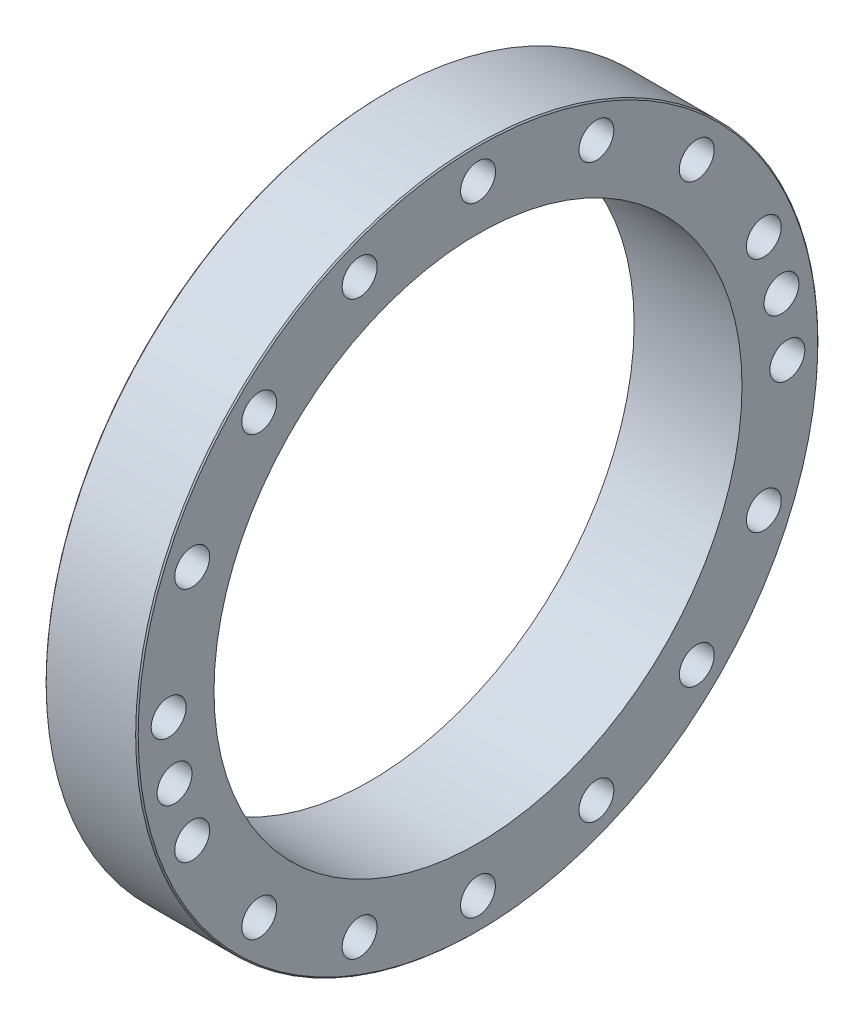
ISO-10303-21;
HEADER;
FILE_DESCRIPTION(('STEP AP214'),'2;1');
FILE_NAME('part.step','',(''),(''),'','','');
FILE_SCHEMA(('AUTOMOTIVE_DESIGN { 1 0 10303 214 1 1 1 1 }'));
ENDSEC;
DATA;
#1=APPLICATION_CONTEXT('core data for automotive mechanical design processes');
#2=APPLICATION_PROTOCOL_DEFINITION('international standard','automotive_design',2000,#1);
#3=PRODUCT_CONTEXT('',#1,'mechanical');
#4=PRODUCT('Part','Part','',(#3));
#5=PRODUCT_RELATED_PRODUCT_CATEGORY('part','',(#4));
#6=PRODUCT_DEFINITION_FORMATION('','',#4);
#7=PRODUCT_DEFINITION_CONTEXT('part definition',#1,'design');
#8=PRODUCT_DEFINITION('design','',#6,#7);
#9=PRODUCT_DEFINITION_SHAPE('','',#8);
#10=(LENGTH_UNIT() NAMED_UNIT(*) SI_UNIT(.MILLI.,.METRE.));
#11=(NAMED_UNIT(*) PLANE_ANGLE_UNIT() SI_UNIT($,.RADIAN.));
#12=(NAMED_UNIT(*) SI_UNIT($,.STERADIAN.) SOLID_ANGLE_UNIT());
#13=UNCERTAINTY_MEASURE_WITH_UNIT(LENGTH_MEASURE(1.E-05),#10,'distance_accuracy_value','');
#14=(GEOMETRIC_REPRESENTATION_CONTEXT(3) GLOBAL_UNCERTAINTY_ASSIGNED_CONTEXT((#13)) GLOBAL_UNIT_ASSIGNED_CONTEXT((#10,
#11,#12)) REPRESENTATION_CONTEXT('',''));
#15=CARTESIAN_POINT('',(0.,0.,0.));
#16=DIRECTION('',(0.,0.,1.));
#17=DIRECTION('',(1.,0.,0.));
#18=AXIS2_PLACEMENT_3D('',#15,#16,#17);
#19=CARTESIAN_POINT('',(60.1,-19.0213063965725,95.626564839315));
#20=DIRECTION('',(-1.,0.,0.));
#21=DIRECTION('',(0.,0.,1.));
#22=AXIS2_PLACEMENT_3D('',#19,#20,#21);
#23=CYLINDRICAL_SURFACE('',#22,4.25);
#24=CARTESIAN_POINT('',(66.8499999999312,-19.0213063965725,95.626564839315));
#25=DIRECTION('',(1.,0.,0.));
#26=DIRECTION('',(0.,0.195090322018536,-0.980785280402751));
#27=AXIS2_PLACEMENT_3D('',#24,#25,#26);
#28=CIRCLE('',#27,4.24999999995026);
#29=CARTESIAN_POINT('',(66.8499999999312,-18.1921725280034,91.4582273976521));
#30=VERTEX_POINT('',#29);
#31=EDGE_CURVE('E30',#30,#30,#28,.T.);
#32=ORIENTED_EDGE('',*,*,#31,.T.);
#33=EDGE_LOOP('',(#32));
#34=FACE_BOUND('',#33,.T.);
#35=CARTESIAN_POINT('',(53.3500000000231,-19.0213063965725,95.626564839315));
#36=DIRECTION('',(-1.,0.,0.));
#37=DIRECTION('',(0.,0.195090322016634,-0.98078528040313));
#38=AXIS2_PLACEMENT_3D('',#35,#36,#37);
#39=CIRCLE('',#38,4.25000000006453);
#40=CARTESIAN_POINT('',(53.3500000000231,-18.1921725279892,91.4582273975384));
#41=VERTEX_POINT('',#40);
#42=EDGE_CURVE('E173',#41,#41,#39,.T.);
#43=ORIENTED_EDGE('',*,*,#42,.T.);
#44=EDGE_LOOP('',(#43));
#45=FACE_BOUND('',#44,.T.);
#46=ADVANCED_FACE('F15',(#34,#45),#23,.F.);
#47=CARTESIAN_POINT('',(60.1,19.0213063965725,-95.626564839315));
#48=DIRECTION('',(-1.,0.,0.));
#49=DIRECTION('',(0.,0.,1.));
#50=AXIS2_PLACEMENT_3D('',#47,#48,#49);
#51=CYLINDRICAL_SURFACE('',#50,4.25);
#52=CARTESIAN_POINT('',(66.8499999999312,19.0213063965725,-95.626564839315));
#53=DIRECTION('',(1.,0.,0.));
#54=DIRECTION('',(0.,-0.195090322018536,0.980785280402751));
#55=AXIS2_PLACEMENT_3D('',#52,#53,#54);
#56=CIRCLE('',#55,4.24999999995026);
#57=CARTESIAN_POINT('',(66.8499999999312,18.1921725280034,-91.4582273976521));
#58=VERTEX_POINT('',#57);
#59=EDGE_CURVE('E179',#58,#58,#56,.T.);
#60=ORIENTED_EDGE('',*,*,#59,.T.);
#61=EDGE_LOOP('',(#60));
#62=FACE_BOUND('',#61,.T.);
#63=CARTESIAN_POINT('',(53.3500000000231,19.0213063965725,-95.626564839315));
#64=DIRECTION('',(-1.,0.,0.));
#65=DIRECTION('',(0.,-0.195090322016634,0.98078528040313));
#66=AXIS2_PLACEMENT_3D('',#63,#64,#65);
#67=CIRCLE('',#66,4.25000000006453);
#68=CARTESIAN_POINT('',(53.3500000000231,18.1921725279892,-91.4582273975384));
#69=VERTEX_POINT('',#68);
#70=EDGE_CURVE('E168',#69,#69,#67,.T.);
#71=ORIENTED_EDGE('',*,*,#70,.T.);
#72=EDGE_LOOP('',(#71));
#73=FACE_BOUND('',#72,.T.);
#74=ADVANCED_FACE('F191',(#62,#73),#51,.F.);
#75=CARTESIAN_POINT('',(67.5999999999704,-19.0213063965725,95.626564839315));
#76=DIRECTION('',(1.,0.,0.));
#77=DIRECTION('',(0.,0.,-1.));
#78=AXIS2_PLACEMENT_3D('',#75,#76,#77);
#79=CONICAL_SURFACE('',#78,4.99999999995781,0.785398163377527);
#80=CARTESIAN_POINT('',(67.5999999999704,-19.0213063965725,95.626564839315));
#81=DIRECTION('',(1.,0.,0.));
#82=DIRECTION('',(0.,0.,-1.));
#83=AXIS2_PLACEMENT_3D('',#80,#81,#82);
#84=CIRCLE('',#83,4.99999999995781);
#85=CARTESIAN_POINT('',(67.5999999999704,-19.0213063965725,90.6265648393572));
#86=VERTEX_POINT('',#85);
#87=EDGE_CURVE('E18',#86,#86,#84,.T.);
#88=ORIENTED_EDGE('',*,*,#87,.T.);
#89=EDGE_LOOP('',(#88));
#90=FACE_BOUND('',#89,.T.);
#91=ORIENTED_EDGE('',*,*,#31,.F.);
#92=EDGE_LOOP('',(#91));
#93=FACE_BOUND('',#92,.T.);
#94=ADVANCED_FACE('F188',(#90,#93),#79,.F.);
#95=CARTESIAN_POINT('',(67.5999999999704,19.0213063965725,-95.626564839315));
#96=DIRECTION('',(1.,0.,0.));
#97=DIRECTION('',(0.,0.,-1.));
#98=AXIS2_PLACEMENT_3D('',#95,#96,#97);
#99=CONICAL_SURFACE('',#98,4.99999999995781,0.785398163377527);
#100=CARTESIAN_POINT('',(67.5999999999704,19.0213063965725,-95.626564839315));
#101=DIRECTION('',(1.,0.,0.));
#102=DIRECTION('',(0.,0.,-1.));
#103=AXIS2_PLACEMENT_3D('',#100,#101,#102);
#104=CIRCLE('',#103,4.99999999995781);
#105=CARTESIAN_POINT('',(67.5999999999704,19.0213063965725,-100.626564839273));
#106=VERTEX_POINT('',#105);
#107=EDGE_CURVE('E159',#106,#106,#104,.T.);
#108=ORIENTED_EDGE('',*,*,#107,.T.);
#109=EDGE_LOOP('',(#108));
#110=FACE_BOUND('',#109,.T.);
#111=ORIENTED_EDGE('',*,*,#59,.F.);
#112=EDGE_LOOP('',(#111));
#113=FACE_BOUND('',#112,.T.);
#114=ADVANCED_FACE('F190',(#110,#113),#99,.F.);
#115=CARTESIAN_POINT('',(52.5999999999271,-19.0213063965725,95.626564839315));
#116=DIRECTION('',(-1.,0.,0.));
#117=DIRECTION('',(0.,0.,1.));
#118=AXIS2_PLACEMENT_3D('',#115,#116,#117);
#119=CONICAL_SURFACE('',#118,5.00000000013338,0.785398163417663);
#120=ORIENTED_EDGE('',*,*,#42,.F.);
#121=EDGE_LOOP('',(#120));
#122=FACE_BOUND('',#121,.T.);
#123=CARTESIAN_POINT('',(52.5999999999666,-19.0213063965725,95.626564839315));
#124=DIRECTION('',(-1.,0.,0.));
#125=DIRECTION('',(0.,0.,1.));
#126=AXIS2_PLACEMENT_3D('',#123,#124,#125);
#127=CIRCLE('',#126,5.00000000009395);
#128=CARTESIAN_POINT('',(52.5999999999666,-19.0213063965725,100.626564839409));
#129=VERTEX_POINT('',#128);
#130=EDGE_CURVE('E157',#129,#129,#127,.F.);
#131=ORIENTED_EDGE('',*,*,#130,.F.);
#132=EDGE_LOOP('',(#131));
#133=FACE_BOUND('',#132,.T.);
#134=ADVANCED_FACE('F198',(#122,#133),#119,.F.);
#135=CARTESIAN_POINT('',(52.5999999999271,19.0213063965725,-95.626564839315));
#136=DIRECTION('',(-1.,0.,0.));
#137=DIRECTION('',(0.,0.,1.));
#138=AXIS2_PLACEMENT_3D('',#135,#136,#137);
#139=CONICAL_SURFACE('',#138,5.00000000013338,0.785398163417663);
#140=ORIENTED_EDGE('',*,*,#70,.F.);
#141=EDGE_LOOP('',(#140));
#142=FACE_BOUND('',#141,.T.);
#143=CARTESIAN_POINT('',(52.5999999999666,19.0213063965725,-95.626564839315));
#144=DIRECTION('',(-1.,0.,0.));
#145=DIRECTION('',(0.,0.,1.));
#146=AXIS2_PLACEMENT_3D('',#143,#144,#145);
#147=CIRCLE('',#146,5.00000000009395);
#148=CARTESIAN_POINT('',(52.5999999999666,19.0213063965725,-90.626564839221));
#149=VERTEX_POINT('',#148);
#150=EDGE_CURVE('E154',#149,#149,#147,.F.);
#151=ORIENTED_EDGE('',*,*,#150,.F.);
#152=EDGE_LOOP('',(#151));
#153=FACE_BOUND('',#152,.T.);
#154=ADVANCED_FACE('F317',(#142,#153),#139,.F.);
#155=CARTESIAN_POINT('',(50.5,0.,0.));
#156=DIRECTION('',(-1.,0.,0.));
#157=DIRECTION('',(0.,0.,1.));
#158=AXIS2_PLACEMENT_3D('',#155,#156,#157);
#159=CYLINDRICAL_SURFACE('',#158,88.5);
#160=CARTESIAN_POINT('',(52.6,0.,0.));
#161=DIRECTION('',(-1.,0.,0.));
#162=DIRECTION('',(0.,0.,1.));
#163=AXIS2_PLACEMENT_3D('',#160,#161,#162);
#164=CIRCLE('',#163,88.5);
#165=CARTESIAN_POINT('',(52.6,0.,88.5));
#166=VERTEX_POINT('',#165);
#167=EDGE_CURVE('E148',#166,#166,#164,.F.);
#168=ORIENTED_EDGE('',*,*,#167,.F.);
#169=EDGE_LOOP('',(#168));
#170=FACE_BOUND('',#169,.T.);
#171=CARTESIAN_POINT('',(48.4,0.,0.));
#172=DIRECTION('',(1.,0.,0.));
#173=DIRECTION('',(0.,0.,1.));
#174=AXIS2_PLACEMENT_3D('',#171,#172,#173);
#175=CIRCLE('',#174,88.5);
#176=CARTESIAN_POINT('',(48.4,0.,88.5));
#177=VERTEX_POINT('',#176);
#178=EDGE_CURVE('E164',#177,#177,#175,.F.);
#179=ORIENTED_EDGE('',*,*,#178,.F.);
#180=EDGE_LOOP('',(#179));
#181=FACE_BOUND('',#180,.T.);
#182=ADVANCED_FACE('F314',(#170,#181),#159,.T.);
#183=CARTESIAN_POINT('',(48.4,0.,0.));
#184=DIRECTION('',(1.,0.,0.));
#185=DIRECTION('',(0.,0.,-1.));
#186=AXIS2_PLACEMENT_3D('',#183,#184,#185);
#187=CONICAL_SURFACE('',#186,88.5,0.785398163397448);
#188=ORIENTED_EDGE('',*,*,#178,.T.);
#189=EDGE_LOOP('',(#188));
#190=FACE_BOUND('',#189,.T.);
#191=CARTESIAN_POINT('',(47.6,0.,0.));
#192=DIRECTION('',(1.,0.,0.));
#193=DIRECTION('',(0.,0.,-1.));
#194=AXIS2_PLACEMENT_3D('',#191,#192,#193);
#195=CIRCLE('',#194,87.7);
#196=CARTESIAN_POINT('',(47.6,0.,-87.7));
#197=VERTEX_POINT('',#196);
#198=EDGE_CURVE('E145',#197,#197,#195,.F.);
#199=ORIENTED_EDGE('',*,*,#198,.F.);
#200=EDGE_LOOP('',(#199));
#201=FACE_BOUND('',#200,.T.);
#202=ADVANCED_FACE('F310',(#190,#201),#187,.T.);
#203=CARTESIAN_POINT('',(53.,0.,0.));
#204=DIRECTION('',(1.,0.,0.));
#205=DIRECTION('',(0.,0.,-1.));
#206=AXIS2_PLACEMENT_3D('',#203,#204,#205);
#207=CONICAL_SURFACE('',#206,107.5,0.785398163397448);
#208=CARTESIAN_POINT('',(53.,0.,0.));
#209=DIRECTION('',(-1.,0.,0.));
#210=DIRECTION('',(0.,0.,1.));
#211=AXIS2_PLACEMENT_3D('',#208,#209,#210);
#212=CIRCLE('',#211,107.5);
#213=CARTESIAN_POINT('',(53.,0.,107.5));
#214=VERTEX_POINT('',#213);
#215=EDGE_CURVE('E144',#214,#214,#212,.F.);
#216=ORIENTED_EDGE('',*,*,#215,.F.);
#217=EDGE_LOOP('',(#216));
#218=FACE_BOUND('',#217,.T.);
#219=CARTESIAN_POINT('',(52.6,0.,0.));
#220=DIRECTION('',(1.,0.,0.));
#221=DIRECTION('',(0.,0.,-1.));
#222=AXIS2_PLACEMENT_3D('',#219,#220,#221);
#223=CIRCLE('',#222,107.1);
#224=CARTESIAN_POINT('',(52.6,0.,-107.1));
#225=VERTEX_POINT('',#224);
#226=EDGE_CURVE('E151',#225,#225,#223,.F.);
#227=ORIENTED_EDGE('',*,*,#226,.F.);
#228=EDGE_LOOP('',(#227));
#229=FACE_BOUND('',#228,.T.);
#230=ADVANCED_FACE('F306',(#218,#229),#207,.T.);
#231=CARTESIAN_POINT('',(67.6,-19.5578047821169,98.3237243604239));
#232=DIRECTION('',(-1.,0.,0.));
#233=DIRECTION('',(0.,0.,1.));
#234=AXIS2_PLACEMENT_3D('',#231,#232,#233);
#235=PLANE('',#234);
#236=CARTESIAN_POINT('',(67.6,-19.0213063965725,95.626564839315));
#237=DIRECTION('',(-1.,0.,0.));
#238=DIRECTION('',(0.,0.,1.));
#239=AXIS2_PLACEMENT_3D('',#236,#237,#238);
#240=CIRCLE('',#239,5.5);
#241=CARTESIAN_POINT('',(67.6,-19.0213063965725,101.126564839315));
#242=VERTEX_POINT('',#241);
#243=EDGE_CURVE('E141',#242,#242,#240,.F.);
#244=ORIENTED_EDGE('',*,*,#243,.T.);
#245=EDGE_LOOP('',(#244));
#246=FACE_BOUND('',#245,.T.);
#247=ORIENTED_EDGE('',*,*,#87,.F.);
#248=EDGE_LOOP('',(#247));
#249=FACE_BOUND('',#248,.T.);
#250=ADVANCED_FACE('F302',(#246,#249),#235,.F.);
#251=CARTESIAN_POINT('',(67.6,19.5578047821169,-98.3237243604239));
#252=DIRECTION('',(-1.,0.,0.));
#253=DIRECTION('',(0.,0.,1.));
#254=AXIS2_PLACEMENT_3D('',#251,#252,#253);
#255=PLANE('',#254);
#256=CARTESIAN_POINT('',(67.6,19.0213063965725,-95.626564839315));
#257=DIRECTION('',(-1.,0.,0.));
#258=DIRECTION('',(0.,0.,1.));
#259=AXIS2_PLACEMENT_3D('',#256,#257,#258);
#260=CIRCLE('',#259,5.5);
#261=CARTESIAN_POINT('',(67.6,19.0213063965725,-90.126564839315));
#262=VERTEX_POINT('',#261);
#263=EDGE_CURVE('E138',#262,#262,#260,.F.);
#264=ORIENTED_EDGE('',*,*,#263,.T.);
#265=EDGE_LOOP('',(#264));
#266=FACE_BOUND('',#265,.T.);
#267=ORIENTED_EDGE('',*,*,#107,.F.);
#268=EDGE_LOOP('',(#267));
#269=FACE_BOUND('',#268,.T.);
#270=ADVANCED_FACE('F298',(#266,#269),#255,.F.);
#271=CARTESIAN_POINT('',(52.6,0.,97.8));
#272=DIRECTION('',(-1.,0.,0.));
#273=DIRECTION('',(0.,0.,1.));
#274=AXIS2_PLACEMENT_3D('',#271,#272,#273);
#275=PLANE('',#274);
#276=ORIENTED_EDGE('',*,*,#167,.T.);
#277=EDGE_LOOP('',(#276));
#278=FACE_BOUND('',#277,.T.);
#279=ORIENTED_EDGE('',*,*,#226,.T.);
#280=EDGE_LOOP('',(#279));
#281=FACE_BOUND('',#280,.T.);
#282=CARTESIAN_POINT('',(52.6,0.,-97.5));
#283=DIRECTION('',(-1.,0.,0.));
#284=DIRECTION('',(0.,0.,1.));
#285=AXIS2_PLACEMENT_3D('',#282,#283,#284);
#286=CIRCLE('',#285,5.5);
#287=CARTESIAN_POINT('',(52.6,0.,-92.));
#288=VERTEX_POINT('',#287);
#289=EDGE_CURVE('E90',#288,#288,#286,.F.);
#290=ORIENTED_EDGE('',*,*,#289,.T.);
#291=EDGE_LOOP('',(#290));
#292=FACE_BOUND('',#291,.T.);
#293=CARTESIAN_POINT('',(52.6,37.3116346555963,-90.0782544198505));
#294=DIRECTION('',(-1.,0.,0.));
#295=DIRECTION('',(0.,0.,1.));
#296=AXIS2_PLACEMENT_3D('',#293,#294,#295);
#297=CIRCLE('',#296,5.5);
#298=CARTESIAN_POINT('',(52.6,37.3116346555963,-84.5782544198505));
#299=VERTEX_POINT('',#298);
#300=EDGE_CURVE('E93',#299,#299,#297,.F.);
#301=ORIENTED_EDGE('',*,*,#300,.T.);
#302=EDGE_LOOP('',(#301));
#303=FACE_BOUND('',#302,.T.);
#304=CARTESIAN_POINT('',(52.6,68.9429111656884,-68.9429111656884));
#305=DIRECTION('',(-1.,0.,0.));
#306=DIRECTION('',(0.,0.,1.));
#307=AXIS2_PLACEMENT_3D('',#304,#305,#306);
#308=CIRCLE('',#307,5.5);
#309=CARTESIAN_POINT('',(52.6,68.9429111656884,-63.4429111656884));
#310=VERTEX_POINT('',#309);
#311=EDGE_CURVE('E96',#310,#310,#308,.F.);
#312=ORIENTED_EDGE('',*,*,#311,.T.);
#313=EDGE_LOOP('',(#312));
#314=FACE_BOUND('',#313,.T.);
#315=CARTESIAN_POINT('',(52.6,90.0782544198505,-37.3116346555963));
#316=DIRECTION('',(-1.,0.,0.));
#317=DIRECTION('',(0.,0.,1.));
#318=AXIS2_PLACEMENT_3D('',#315,#316,#317);
#319=CIRCLE('',#318,5.5);
#320=CARTESIAN_POINT('',(52.6,90.0782544198505,-31.8116346555963));
#321=VERTEX_POINT('',#320);
#322=EDGE_CURVE('E99',#321,#321,#319,.F.);
#323=ORIENTED_EDGE('',*,*,#322,.T.);
#324=EDGE_LOOP('',(#323));
#325=FACE_BOUND('',#324,.T.);
#326=CARTESIAN_POINT('',(52.6,97.5,0.));
#327=DIRECTION('',(-1.,0.,0.));
#328=DIRECTION('',(0.,0.,1.));
#329=AXIS2_PLACEMENT_3D('',#326,#327,#328);
#330=CIRCLE('',#329,5.5);
#331=CARTESIAN_POINT('',(52.6,97.5,5.5));
#332=VERTEX_POINT('',#331);
#333=EDGE_CURVE('E102',#332,#332,#330,.F.);
#334=ORIENTED_EDGE('',*,*,#333,.T.);
#335=EDGE_LOOP('',(#334));
#336=FACE_BOUND('',#335,.T.);
#337=CARTESIAN_POINT('',(52.6,90.0782544198505,37.3116346555963));
#338=DIRECTION('',(-1.,0.,0.));
#339=DIRECTION('',(0.,0.,1.));
#340=AXIS2_PLACEMENT_3D('',#337,#338,#339);
#341=CIRCLE('',#340,5.5);
#342=CARTESIAN_POINT('',(52.6,90.0782544198505,42.8116346555963));
#343=VERTEX_POINT('',#342);
#344=EDGE_CURVE('E105',#343,#343,#341,.F.);
#345=ORIENTED_EDGE('',*,*,#344,.T.);
#346=EDGE_LOOP('',(#345));
#347=FACE_BOUND('',#346,.T.);
#348=CARTESIAN_POINT('',(52.6,68.9429111656884,68.9429111656884));
#349=DIRECTION('',(-1.,0.,0.));
#350=DIRECTION('',(0.,0.,1.));
#351=AXIS2_PLACEMENT_3D('',#348,#349,#350);
#352=CIRCLE('',#351,5.5);
#353=CARTESIAN_POINT('',(52.6,68.9429111656884,74.4429111656884));
#354=VERTEX_POINT('',#353);
#355=EDGE_CURVE('E108',#354,#354,#352,.F.);
#356=ORIENTED_EDGE('',*,*,#355,.T.);
#357=EDGE_LOOP('',(#356));
#358=FACE_BOUND('',#357,.T.);
#359=CARTESIAN_POINT('',(52.6,37.3116346555962,90.0782544198505));
#360=DIRECTION('',(-1.,0.,0.));
#361=DIRECTION('',(0.,0.,1.));
#362=AXIS2_PLACEMENT_3D('',#359,#360,#361);
#363=CIRCLE('',#362,5.5);
#364=CARTESIAN_POINT('',(52.6,37.3116346555962,95.5782544198505));
#365=VERTEX_POINT('',#364);
#366=EDGE_CURVE('E111',#365,#365,#363,.F.);
#367=ORIENTED_EDGE('',*,*,#366,.T.);
#368=EDGE_LOOP('',(#367));
#369=FACE_BOUND('',#368,.T.);
#370=CARTESIAN_POINT('',(52.6,0.,97.5));
#371=DIRECTION('',(-1.,0.,0.));
#372=DIRECTION('',(0.,0.,1.));
#373=AXIS2_PLACEMENT_3D('',#370,#371,#372);
#374=CIRCLE('',#373,5.5);
#375=CARTESIAN_POINT('',(52.6,0.,103.));
#376=VERTEX_POINT('',#375);
#377=EDGE_CURVE('E114',#376,#376,#374,.F.);
#378=ORIENTED_EDGE('',*,*,#377,.T.);
#379=EDGE_LOOP('',(#378));
#380=FACE_BOUND('',#379,.T.);
#381=CARTESIAN_POINT('',(52.6,-37.3116346555962,90.0782544198505));
#382=DIRECTION('',(-1.,0.,0.));
#383=DIRECTION('',(0.,0.,1.));
#384=AXIS2_PLACEMENT_3D('',#381,#382,#383);
#385=CIRCLE('',#384,5.5);
#386=CARTESIAN_POINT('',(52.6,-37.3116346555962,95.5782544198505));
#387=VERTEX_POINT('',#386);
#388=EDGE_CURVE('E117',#387,#387,#385,.F.);
#389=ORIENTED_EDGE('',*,*,#388,.T.);
#390=EDGE_LOOP('',(#389));
#391=FACE_BOUND('',#390,.T.);
#392=CARTESIAN_POINT('',(52.6,-68.9429111656884,68.9429111656884));
#393=DIRECTION('',(-1.,0.,0.));
#394=DIRECTION('',(0.,0.,1.));
#395=AXIS2_PLACEMENT_3D('',#392,#393,#394);
#396=CIRCLE('',#395,5.5);
#397=CARTESIAN_POINT('',(52.6,-68.9429111656884,74.4429111656884));
#398=VERTEX_POINT('',#397);
#399=EDGE_CURVE('E120',#398,#398,#396,.F.);
#400=ORIENTED_EDGE('',*,*,#399,.T.);
#401=EDGE_LOOP('',(#400));
#402=FACE_BOUND('',#401,.T.);
#403=CARTESIAN_POINT('',(52.6,-90.0782544198505,37.3116346555962));
#404=DIRECTION('',(-1.,0.,0.));
#405=DIRECTION('',(0.,0.,1.));
#406=AXIS2_PLACEMENT_3D('',#403,#404,#405);
#407=CIRCLE('',#406,5.5);
#408=CARTESIAN_POINT('',(52.6,-90.0782544198505,42.8116346555962));
#409=VERTEX_POINT('',#408);
#410=EDGE_CURVE('E123',#409,#409,#407,.F.);
#411=ORIENTED_EDGE('',*,*,#410,.T.);
#412=EDGE_LOOP('',(#411));
#413=FACE_BOUND('',#412,.T.);
#414=CARTESIAN_POINT('',(52.6,-97.5,0.));
#415=DIRECTION('',(-1.,0.,0.));
#416=DIRECTION('',(0.,0.,1.));
#417=AXIS2_PLACEMENT_3D('',#414,#415,#416);
#418=CIRCLE('',#417,5.5);
#419=CARTESIAN_POINT('',(52.6,-97.5,5.5));
#420=VERTEX_POINT('',#419);
#421=EDGE_CURVE('E126',#420,#420,#418,.F.);
#422=ORIENTED_EDGE('',*,*,#421,.T.);
#423=EDGE_LOOP('',(#422));
#424=FACE_BOUND('',#423,.T.);
#425=CARTESIAN_POINT('',(52.6,-90.0782544198505,-37.3116346555963));
#426=DIRECTION('',(-1.,0.,0.));
#427=DIRECTION('',(0.,0.,1.));
#428=AXIS2_PLACEMENT_3D('',#425,#426,#427);
#429=CIRCLE('',#428,5.5);
#430=CARTESIAN_POINT('',(52.6,-90.0782544198505,-31.8116346555963));
#431=VERTEX_POINT('',#430);
#432=EDGE_CURVE('E129',#431,#431,#429,.F.);
#433=ORIENTED_EDGE('',*,*,#432,.T.);
#434=EDGE_LOOP('',(#433));
#435=FACE_BOUND('',#434,.T.);
#436=CARTESIAN_POINT('',(52.6,-68.9429111656883,-68.9429111656884));
#437=DIRECTION('',(-1.,0.,0.));
#438=DIRECTION('',(0.,0.,1.));
#439=AXIS2_PLACEMENT_3D('',#436,#437,#438);
#440=CIRCLE('',#439,5.5);
#441=CARTESIAN_POINT('',(52.6,-68.9429111656883,-63.4429111656884));
#442=VERTEX_POINT('',#441);
#443=EDGE_CURVE('E132',#442,#442,#440,.F.);
#444=ORIENTED_EDGE('',*,*,#443,.T.);
#445=EDGE_LOOP('',(#444));
#446=FACE_BOUND('',#445,.T.);
#447=CARTESIAN_POINT('',(52.6,-37.3116346555962,-90.0782544198505));
#448=DIRECTION('',(-1.,0.,0.));
#449=DIRECTION('',(0.,0.,1.));
#450=AXIS2_PLACEMENT_3D('',#447,#448,#449);
#451=CIRCLE('',#450,5.5);
#452=CARTESIAN_POINT('',(52.6,-37.3116346555962,-84.5782544198505));
#453=VERTEX_POINT('',#452);
#454=EDGE_CURVE('E135',#453,#453,#451,.F.);
#455=ORIENTED_EDGE('',*,*,#454,.T.);
#456=EDGE_LOOP('',(#455));
#457=FACE_BOUND('',#456,.T.);
#458=ORIENTED_EDGE('',*,*,#150,.T.);
#459=EDGE_LOOP('',(#458));
#460=FACE_BOUND('',#459,.T.);
#461=ORIENTED_EDGE('',*,*,#130,.T.);
#462=EDGE_LOOP('',(#461));
#463=FACE_BOUND('',#462,.T.);
#464=ADVANCED_FACE('F294',(#278,#281,#292,#303,#314,#325,#336,#347,#358,#369,#380,#391,#402,
#413,#424,#435,#446,#457,#460,#463),#275,.T.);
#465=CARTESIAN_POINT('',(47.6,0.,85.452));
#466=DIRECTION('',(-1.,0.,0.));
#467=DIRECTION('',(0.,0.,1.));
#468=AXIS2_PLACEMENT_3D('',#465,#466,#467);
#469=PLANE('',#468);
#470=CARTESIAN_POINT('',(47.6,0.,0.));
#471=DIRECTION('',(-1.,0.,0.));
#472=DIRECTION('',(0.,0.,1.));
#473=AXIS2_PLACEMENT_3D('',#470,#471,#472);
#474=CIRCLE('',#473,83.204);
#475=CARTESIAN_POINT('',(47.6,0.,83.204));
#476=VERTEX_POINT('',#475);
#477=EDGE_CURVE('E87',#476,#476,#474,.F.);
#478=ORIENTED_EDGE('',*,*,#477,.T.);
#479=EDGE_LOOP('',(#478));
#480=FACE_BOUND('',#479,.T.);
#481=ORIENTED_EDGE('',*,*,#198,.T.);
#482=EDGE_LOOP('',(#481));
#483=FACE_BOUND('',#482,.T.);
#484=ADVANCED_FACE('F290',(#480,#483),#469,.T.);
#485=CARTESIAN_POINT('',(67.1,0.,0.));
#486=DIRECTION('',(-1.,0.,0.));
#487=DIRECTION('',(0.,0.,1.));
#488=AXIS2_PLACEMENT_3D('',#485,#486,#487);
#489=CYLINDRICAL_SURFACE('',#488,107.5);
#490=CARTESIAN_POINT('',(81.2,0.,0.));
#491=DIRECTION('',(-1.,0.,0.));
#492=DIRECTION('',(0.,0.,1.));
#493=AXIS2_PLACEMENT_3D('',#490,#491,#492);
#494=CIRCLE('',#493,107.5);
#495=CARTESIAN_POINT('',(81.2,0.,107.5));
#496=VERTEX_POINT('',#495);
#497=EDGE_CURVE('E86',#496,#496,#494,.F.);
#498=ORIENTED_EDGE('',*,*,#497,.F.);
#499=EDGE_LOOP('',(#498));
#500=FACE_BOUND('',#499,.T.);
#501=ORIENTED_EDGE('',*,*,#215,.T.);
#502=EDGE_LOOP('',(#501));
#503=FACE_BOUND('',#502,.T.);
#504=ADVANCED_FACE('F286',(#500,#503),#489,.T.);
#505=CARTESIAN_POINT('',(74.6,-19.0213063965725,95.626564839315));
#506=DIRECTION('',(-1.,0.,0.));
#507=DIRECTION('',(0.,0.,1.));
#508=AXIS2_PLACEMENT_3D('',#505,#506,#507);
#509=CYLINDRICAL_SURFACE('',#508,5.5);
#510=CARTESIAN_POINT('',(81.6,-19.0213063965725,95.626564839315));
#511=DIRECTION('',(-1.,0.,0.));
#512=DIRECTION('',(0.,0.,1.));
#513=AXIS2_PLACEMENT_3D('',#510,#511,#512);
#514=CIRCLE('',#513,5.5);
#515=CARTESIAN_POINT('',(81.6,-19.0213063965725,101.126564839315));
#516=VERTEX_POINT('',#515);
#517=EDGE_CURVE('E83',#516,#516,#514,.T.);
#518=ORIENTED_EDGE('',*,*,#517,.F.);
#519=EDGE_LOOP('',(#518));
#520=FACE_BOUND('',#519,.T.);
#521=ORIENTED_EDGE('',*,*,#243,.F.);
#522=EDGE_LOOP('',(#521));
#523=FACE_BOUND('',#522,.T.);
#524=ADVANCED_FACE('F282',(#520,#523),#509,.F.);
#525=CARTESIAN_POINT('',(74.6,19.0213063965725,-95.626564839315));
#526=DIRECTION('',(-1.,0.,0.));
#527=DIRECTION('',(0.,0.,1.));
#528=AXIS2_PLACEMENT_3D('',#525,#526,#527);
#529=CYLINDRICAL_SURFACE('',#528,5.5);
#530=CARTESIAN_POINT('',(81.6,19.0213063965725,-95.626564839315));
#531=DIRECTION('',(-1.,0.,0.));
#532=DIRECTION('',(0.,0.,1.));
#533=AXIS2_PLACEMENT_3D('',#530,#531,#532);
#534=CIRCLE('',#533,5.5);
#535=CARTESIAN_POINT('',(81.6,19.0213063965725,-90.126564839315));
#536=VERTEX_POINT('',#535);
#537=EDGE_CURVE('E80',#536,#536,#534,.T.);
#538=ORIENTED_EDGE('',*,*,#537,.F.);
#539=EDGE_LOOP('',(#538));
#540=FACE_BOUND('',#539,.T.);
#541=ORIENTED_EDGE('',*,*,#263,.F.);
#542=EDGE_LOOP('',(#541));
#543=FACE_BOUND('',#542,.T.);
#544=ADVANCED_FACE('F278',(#540,#543),#529,.F.);
#545=CARTESIAN_POINT('',(67.1,-37.3116346555962,-90.0782544198505));
#546=DIRECTION('',(-1.,0.,0.));
#547=DIRECTION('',(0.,0.,1.));
#548=AXIS2_PLACEMENT_3D('',#545,#546,#547);
#549=CYLINDRICAL_SURFACE('',#548,5.5);
#550=CARTESIAN_POINT('',(81.6,-37.3116346555962,-90.0782544198505));
#551=DIRECTION('',(-1.,0.,0.));
#552=DIRECTION('',(0.,0.,1.));
#553=AXIS2_PLACEMENT_3D('',#550,#551,#552);
#554=CIRCLE('',#553,5.5);
#555=CARTESIAN_POINT('',(81.6,-37.3116346555962,-84.5782544198505));
#556=VERTEX_POINT('',#555);
#557=EDGE_CURVE('E77',#556,#556,#554,.T.);
#558=ORIENTED_EDGE('',*,*,#557,.F.);
#559=EDGE_LOOP('',(#558));
#560=FACE_BOUND('',#559,.T.);
#561=ORIENTED_EDGE('',*,*,#454,.F.);
#562=EDGE_LOOP('',(#561));
#563=FACE_BOUND('',#562,.T.);
#564=ADVANCED_FACE('F274',(#560,#563),#549,.F.);
#565=CARTESIAN_POINT('',(67.1,-68.9429111656883,-68.9429111656884));
#566=DIRECTION('',(-1.,0.,0.));
#567=DIRECTION('',(0.,0.,1.));
#568=AXIS2_PLACEMENT_3D('',#565,#566,#567);
#569=CYLINDRICAL_SURFACE('',#568,5.5);
#570=CARTESIAN_POINT('',(81.6,-68.9429111656883,-68.9429111656884));
#571=DIRECTION('',(-1.,0.,0.));
#572=DIRECTION('',(0.,0.,1.));
#573=AXIS2_PLACEMENT_3D('',#570,#571,#572);
#574=CIRCLE('',#573,5.5);
#575=CARTESIAN_POINT('',(81.6,-68.9429111656883,-63.4429111656884));
#576=VERTEX_POINT('',#575);
#577=EDGE_CURVE('E74',#576,#576,#574,.T.);
#578=ORIENTED_EDGE('',*,*,#577,.F.);
#579=EDGE_LOOP('',(#578));
#580=FACE_BOUND('',#579,.T.);
#581=ORIENTED_EDGE('',*,*,#443,.F.);
#582=EDGE_LOOP('',(#581));
#583=FACE_BOUND('',#582,.T.);
#584=ADVANCED_FACE('F270',(#580,#583),#569,.F.);
#585=CARTESIAN_POINT('',(67.1,-90.0782544198505,-37.3116346555963));
#586=DIRECTION('',(-1.,0.,0.));
#587=DIRECTION('',(0.,0.,1.));
#588=AXIS2_PLACEMENT_3D('',#585,#586,#587);
#589=CYLINDRICAL_SURFACE('',#588,5.5);
#590=CARTESIAN_POINT('',(81.6,-90.0782544198505,-37.3116346555963));
#591=DIRECTION('',(-1.,0.,0.));
#592=DIRECTION('',(0.,0.,1.));
#593=AXIS2_PLACEMENT_3D('',#590,#591,#592);
#594=CIRCLE('',#593,5.5);
#595=CARTESIAN_POINT('',(81.6,-90.0782544198505,-31.8116346555963));
#596=VERTEX_POINT('',#595);
#597=EDGE_CURVE('E71',#596,#596,#594,.T.);
#598=ORIENTED_EDGE('',*,*,#597,.F.);
#599=EDGE_LOOP('',(#598));
#600=FACE_BOUND('',#599,.T.);
#601=ORIENTED_EDGE('',*,*,#432,.F.);
#602=EDGE_LOOP('',(#601));
#603=FACE_BOUND('',#602,.T.);
#604=ADVANCED_FACE('F266',(#600,#603),#589,.F.);
#605=CARTESIAN_POINT('',(67.1,-97.5,0.));
#606=DIRECTION('',(-1.,0.,0.));
#607=DIRECTION('',(0.,0.,1.));
#608=AXIS2_PLACEMENT_3D('',#605,#606,#607);
#609=CYLINDRICAL_SURFACE('',#608,5.5);
#610=CARTESIAN_POINT('',(81.6,-97.5,0.));
#611=DIRECTION('',(-1.,0.,0.));
#612=DIRECTION('',(0.,0.,1.));
#613=AXIS2_PLACEMENT_3D('',#610,#611,#612);
#614=CIRCLE('',#613,5.5);
#615=CARTESIAN_POINT('',(81.6,-97.5,5.5));
#616=VERTEX_POINT('',#615);
#617=EDGE_CURVE('E68',#616,#616,#614,.T.);
#618=ORIENTED_EDGE('',*,*,#617,.F.);
#619=EDGE_LOOP('',(#618));
#620=FACE_BOUND('',#619,.T.);
#621=ORIENTED_EDGE('',*,*,#421,.F.);
#622=EDGE_LOOP('',(#621));
#623=FACE_BOUND('',#622,.T.);
#624=ADVANCED_FACE('F262',(#620,#623),#609,.F.);
#625=CARTESIAN_POINT('',(67.1,-90.0782544198505,37.3116346555962));
#626=DIRECTION('',(-1.,0.,0.));
#627=DIRECTION('',(0.,0.,1.));
#628=AXIS2_PLACEMENT_3D('',#625,#626,#627);
#629=CYLINDRICAL_SURFACE('',#628,5.5);
#630=CARTESIAN_POINT('',(81.6,-90.0782544198505,37.3116346555962));
#631=DIRECTION('',(-1.,0.,0.));
#632=DIRECTION('',(0.,0.,1.));
#633=AXIS2_PLACEMENT_3D('',#630,#631,#632);
#634=CIRCLE('',#633,5.5);
#635=CARTESIAN_POINT('',(81.6,-90.0782544198505,42.8116346555962));
#636=VERTEX_POINT('',#635);
#637=EDGE_CURVE('E65',#636,#636,#634,.T.);
#638=ORIENTED_EDGE('',*,*,#637,.F.);
#639=EDGE_LOOP('',(#638));
#640=FACE_BOUND('',#639,.T.);
#641=ORIENTED_EDGE('',*,*,#410,.F.);
#642=EDGE_LOOP('',(#641));
#643=FACE_BOUND('',#642,.T.);
#644=ADVANCED_FACE('F258',(#640,#643),#629,.F.);
#645=CARTESIAN_POINT('',(67.1,-68.9429111656884,68.9429111656884));
#646=DIRECTION('',(-1.,0.,0.));
#647=DIRECTION('',(0.,0.,1.));
#648=AXIS2_PLACEMENT_3D('',#645,#646,#647);
#649=CYLINDRICAL_SURFACE('',#648,5.5);
#650=CARTESIAN_POINT('',(81.6,-68.9429111656884,68.9429111656884));
#651=DIRECTION('',(-1.,0.,0.));
#652=DIRECTION('',(0.,0.,1.));
#653=AXIS2_PLACEMENT_3D('',#650,#651,#652);
#654=CIRCLE('',#653,5.5);
#655=CARTESIAN_POINT('',(81.6,-68.9429111656884,74.4429111656884));
#656=VERTEX_POINT('',#655);
#657=EDGE_CURVE('E62',#656,#656,#654,.T.);
#658=ORIENTED_EDGE('',*,*,#657,.F.);
#659=EDGE_LOOP('',(#658));
#660=FACE_BOUND('',#659,.T.);
#661=ORIENTED_EDGE('',*,*,#399,.F.);
#662=EDGE_LOOP('',(#661));
#663=FACE_BOUND('',#662,.T.);
#664=ADVANCED_FACE('F254',(#660,#663),#649,.F.);
#665=CARTESIAN_POINT('',(67.1,-37.3116346555962,90.0782544198505));
#666=DIRECTION('',(-1.,0.,0.));
#667=DIRECTION('',(0.,0.,1.));
#668=AXIS2_PLACEMENT_3D('',#665,#666,#667);
#669=CYLINDRICAL_SURFACE('',#668,5.5);
#670=CARTESIAN_POINT('',(81.6,-37.3116346555962,90.0782544198505));
#671=DIRECTION('',(-1.,0.,0.));
#672=DIRECTION('',(0.,0.,1.));
#673=AXIS2_PLACEMENT_3D('',#670,#671,#672);
#674=CIRCLE('',#673,5.5);
#675=CARTESIAN_POINT('',(81.6,-37.3116346555962,95.5782544198505));
#676=VERTEX_POINT('',#675);
#677=EDGE_CURVE('E59',#676,#676,#674,.T.);
#678=ORIENTED_EDGE('',*,*,#677,.F.);
#679=EDGE_LOOP('',(#678));
#680=FACE_BOUND('',#679,.T.);
#681=ORIENTED_EDGE('',*,*,#388,.F.);
#682=EDGE_LOOP('',(#681));
#683=FACE_BOUND('',#682,.T.);
#684=ADVANCED_FACE('F250',(#680,#683),#669,.F.);
#685=CARTESIAN_POINT('',(67.1,0.,97.5));
#686=DIRECTION('',(-1.,0.,0.));
#687=DIRECTION('',(0.,0.,1.));
#688=AXIS2_PLACEMENT_3D('',#685,#686,#687);
#689=CYLINDRICAL_SURFACE('',#688,5.5);
#690=CARTESIAN_POINT('',(81.6,0.,97.5));
#691=DIRECTION('',(-1.,0.,0.));
#692=DIRECTION('',(0.,0.,1.));
#693=AXIS2_PLACEMENT_3D('',#690,#691,#692);
#694=CIRCLE('',#693,5.5);
#695=CARTESIAN_POINT('',(81.6,0.,103.));
#696=VERTEX_POINT('',#695);
#697=EDGE_CURVE('E56',#696,#696,#694,.T.);
#698=ORIENTED_EDGE('',*,*,#697,.F.);
#699=EDGE_LOOP('',(#698));
#700=FACE_BOUND('',#699,.T.);
#701=ORIENTED_EDGE('',*,*,#377,.F.);
#702=EDGE_LOOP('',(#701));
#703=FACE_BOUND('',#702,.T.);
#704=ADVANCED_FACE('F246',(#700,#703),#689,.F.);
#705=CARTESIAN_POINT('',(67.1,37.3116346555962,90.0782544198505));
#706=DIRECTION('',(-1.,0.,0.));
#707=DIRECTION('',(0.,0.,1.));
#708=AXIS2_PLACEMENT_3D('',#705,#706,#707);
#709=CYLINDRICAL_SURFACE('',#708,5.5);
#710=CARTESIAN_POINT('',(81.6,37.3116346555962,90.0782544198505));
#711=DIRECTION('',(-1.,0.,0.));
#712=DIRECTION('',(0.,0.,1.));
#713=AXIS2_PLACEMENT_3D('',#710,#711,#712);
#714=CIRCLE('',#713,5.5);
#715=CARTESIAN_POINT('',(81.6,37.3116346555962,95.5782544198505));
#716=VERTEX_POINT('',#715);
#717=EDGE_CURVE('E53',#716,#716,#714,.T.);
#718=ORIENTED_EDGE('',*,*,#717,.F.);
#719=EDGE_LOOP('',(#718));
#720=FACE_BOUND('',#719,.T.);
#721=ORIENTED_EDGE('',*,*,#366,.F.);
#722=EDGE_LOOP('',(#721));
#723=FACE_BOUND('',#722,.T.);
#724=ADVANCED_FACE('F242',(#720,#723),#709,.F.);
#725=CARTESIAN_POINT('',(67.1,68.9429111656884,68.9429111656884));
#726=DIRECTION('',(-1.,0.,0.));
#727=DIRECTION('',(0.,0.,1.));
#728=AXIS2_PLACEMENT_3D('',#725,#726,#727);
#729=CYLINDRICAL_SURFACE('',#728,5.5);
#730=CARTESIAN_POINT('',(81.6,68.9429111656884,68.9429111656884));
#731=DIRECTION('',(-1.,0.,0.));
#732=DIRECTION('',(0.,0.,1.));
#733=AXIS2_PLACEMENT_3D('',#730,#731,#732);
#734=CIRCLE('',#733,5.5);
#735=CARTESIAN_POINT('',(81.6,68.9429111656884,74.4429111656884));
#736=VERTEX_POINT('',#735);
#737=EDGE_CURVE('E50',#736,#736,#734,.T.);
#738=ORIENTED_EDGE('',*,*,#737,.F.);
#739=EDGE_LOOP('',(#738));
#740=FACE_BOUND('',#739,.T.);
#741=ORIENTED_EDGE('',*,*,#355,.F.);
#742=EDGE_LOOP('',(#741));
#743=FACE_BOUND('',#742,.T.);
#744=ADVANCED_FACE('F238',(#740,#743),#729,.F.);
#745=CARTESIAN_POINT('',(67.1,90.0782544198505,37.3116346555963));
#746=DIRECTION('',(-1.,0.,0.));
#747=DIRECTION('',(0.,0.,1.));
#748=AXIS2_PLACEMENT_3D('',#745,#746,#747);
#749=CYLINDRICAL_SURFACE('',#748,5.5);
#750=CARTESIAN_POINT('',(81.6,90.0782544198505,37.3116346555963));
#751=DIRECTION('',(-1.,0.,0.));
#752=DIRECTION('',(0.,0.,1.));
#753=AXIS2_PLACEMENT_3D('',#750,#751,#752);
#754=CIRCLE('',#753,5.5);
#755=CARTESIAN_POINT('',(81.6,90.0782544198505,42.8116346555963));
#756=VERTEX_POINT('',#755);
#757=EDGE_CURVE('E47',#756,#756,#754,.T.);
#758=ORIENTED_EDGE('',*,*,#757,.F.);
#759=EDGE_LOOP('',(#758));
#760=FACE_BOUND('',#759,.T.);
#761=ORIENTED_EDGE('',*,*,#344,.F.);
#762=EDGE_LOOP('',(#761));
#763=FACE_BOUND('',#762,.T.);
#764=ADVANCED_FACE('F234',(#760,#763),#749,.F.);
#765=CARTESIAN_POINT('',(67.1,97.5,0.));
#766=DIRECTION('',(-1.,0.,0.));
#767=DIRECTION('',(0.,0.,1.));
#768=AXIS2_PLACEMENT_3D('',#765,#766,#767);
#769=CYLINDRICAL_SURFACE('',#768,5.5);
#770=CARTESIAN_POINT('',(81.6,97.5,0.));
#771=DIRECTION('',(-1.,0.,0.));
#772=DIRECTION('',(0.,0.,1.));
#773=AXIS2_PLACEMENT_3D('',#770,#771,#772);
#774=CIRCLE('',#773,5.5);
#775=CARTESIAN_POINT('',(81.6,97.5,5.5));
#776=VERTEX_POINT('',#775);
#777=EDGE_CURVE('E44',#776,#776,#774,.T.);
#778=ORIENTED_EDGE('',*,*,#777,.F.);
#779=EDGE_LOOP('',(#778));
#780=FACE_BOUND('',#779,.T.);
#781=ORIENTED_EDGE('',*,*,#333,.F.);
#782=EDGE_LOOP('',(#781));
#783=FACE_BOUND('',#782,.T.);
#784=ADVANCED_FACE('F230',(#780,#783),#769,.F.);
#785=CARTESIAN_POINT('',(67.1,90.0782544198505,-37.3116346555963));
#786=DIRECTION('',(-1.,0.,0.));
#787=DIRECTION('',(0.,0.,1.));
#788=AXIS2_PLACEMENT_3D('',#785,#786,#787);
#789=CYLINDRICAL_SURFACE('',#788,5.5);
#790=CARTESIAN_POINT('',(81.6,90.0782544198505,-37.3116346555963));
#791=DIRECTION('',(-1.,0.,0.));
#792=DIRECTION('',(0.,0.,1.));
#793=AXIS2_PLACEMENT_3D('',#790,#791,#792);
#794=CIRCLE('',#793,5.5);
#795=CARTESIAN_POINT('',(81.6,90.0782544198505,-31.8116346555963));
#796=VERTEX_POINT('',#795);
#797=EDGE_CURVE('E41',#796,#796,#794,.T.);
#798=ORIENTED_EDGE('',*,*,#797,.F.);
#799=EDGE_LOOP('',(#798));
#800=FACE_BOUND('',#799,.T.);
#801=ORIENTED_EDGE('',*,*,#322,.F.);
#802=EDGE_LOOP('',(#801));
#803=FACE_BOUND('',#802,.T.);
#804=ADVANCED_FACE('F226',(#800,#803),#789,.F.);
#805=CARTESIAN_POINT('',(67.1,68.9429111656884,-68.9429111656884));
#806=DIRECTION('',(-1.,0.,0.));
#807=DIRECTION('',(0.,0.,1.));
#808=AXIS2_PLACEMENT_3D('',#805,#806,#807);
#809=CYLINDRICAL_SURFACE('',#808,5.5);
#810=CARTESIAN_POINT('',(81.6,68.9429111656884,-68.9429111656884));
#811=DIRECTION('',(-1.,0.,0.));
#812=DIRECTION('',(0.,0.,1.));
#813=AXIS2_PLACEMENT_3D('',#810,#811,#812);
#814=CIRCLE('',#813,5.5);
#815=CARTESIAN_POINT('',(81.6,68.9429111656884,-63.4429111656884));
#816=VERTEX_POINT('',#815);
#817=EDGE_CURVE('E38',#816,#816,#814,.T.);
#818=ORIENTED_EDGE('',*,*,#817,.F.);
#819=EDGE_LOOP('',(#818));
#820=FACE_BOUND('',#819,.T.);
#821=ORIENTED_EDGE('',*,*,#311,.F.);
#822=EDGE_LOOP('',(#821));
#823=FACE_BOUND('',#822,.T.);
#824=ADVANCED_FACE('F222',(#820,#823),#809,.F.);
#825=CARTESIAN_POINT('',(67.1,37.3116346555963,-90.0782544198505));
#826=DIRECTION('',(-1.,0.,0.));
#827=DIRECTION('',(0.,0.,1.));
#828=AXIS2_PLACEMENT_3D('',#825,#826,#827);
#829=CYLINDRICAL_SURFACE('',#828,5.5);
#830=CARTESIAN_POINT('',(81.6,37.3116346555963,-90.0782544198505));
#831=DIRECTION('',(-1.,0.,0.));
#832=DIRECTION('',(0.,0.,1.));
#833=AXIS2_PLACEMENT_3D('',#830,#831,#832);
#834=CIRCLE('',#833,5.5);
#835=CARTESIAN_POINT('',(81.6,37.3116346555963,-84.5782544198505));
#836=VERTEX_POINT('',#835);
#837=EDGE_CURVE('E35',#836,#836,#834,.T.);
#838=ORIENTED_EDGE('',*,*,#837,.F.);
#839=EDGE_LOOP('',(#838));
#840=FACE_BOUND('',#839,.T.);
#841=ORIENTED_EDGE('',*,*,#300,.F.);
#842=EDGE_LOOP('',(#841));
#843=FACE_BOUND('',#842,.T.);
#844=ADVANCED_FACE('F218',(#840,#843),#829,.F.);
#845=CARTESIAN_POINT('',(67.1,0.,-97.5));
#846=DIRECTION('',(-1.,0.,0.));
#847=DIRECTION('',(0.,0.,1.));
#848=AXIS2_PLACEMENT_3D('',#845,#846,#847);
#849=CYLINDRICAL_SURFACE('',#848,5.5);
#850=CARTESIAN_POINT('',(81.6,0.,-97.5));
#851=DIRECTION('',(-1.,0.,0.));
#852=DIRECTION('',(0.,0.,1.));
#853=AXIS2_PLACEMENT_3D('',#850,#851,#852);
#854=CIRCLE('',#853,5.5);
#855=CARTESIAN_POINT('',(81.6,0.,-92.));
#856=VERTEX_POINT('',#855);
#857=EDGE_CURVE('E27',#856,#856,#854,.T.);
#858=ORIENTED_EDGE('',*,*,#857,.F.);
#859=EDGE_LOOP('',(#858));
#860=FACE_BOUND('',#859,.T.);
#861=ORIENTED_EDGE('',*,*,#289,.F.);
#862=EDGE_LOOP('',(#861));
#863=FACE_BOUND('',#862,.T.);
#864=ADVANCED_FACE('F214',(#860,#863),#849,.F.);
#865=CARTESIAN_POINT('',(64.6,0.,0.));
#866=DIRECTION('',(-1.,0.,0.));
#867=DIRECTION('',(0.,0.,1.));
#868=AXIS2_PLACEMENT_3D('',#865,#866,#867);
#869=CYLINDRICAL_SURFACE('',#868,83.204);
#870=ORIENTED_EDGE('',*,*,#477,.F.);
#871=EDGE_LOOP('',(#870));
#872=FACE_BOUND('',#871,.T.);
#873=CARTESIAN_POINT('',(81.6,0.,0.));
#874=DIRECTION('',(-1.,0.,0.));
#875=DIRECTION('',(0.,0.,1.));
#876=AXIS2_PLACEMENT_3D('',#873,#874,#875);
#877=CIRCLE('',#876,83.204);
#878=CARTESIAN_POINT('',(81.6,0.,83.204));
#879=VERTEX_POINT('',#878);
#880=EDGE_CURVE('E22',#879,#879,#877,.T.);
#881=ORIENTED_EDGE('',*,*,#880,.F.);
#882=EDGE_LOOP('',(#881));
#883=FACE_BOUND('',#882,.T.);
#884=ADVANCED_FACE('F207',(#872,#883),#869,.F.);
#885=CARTESIAN_POINT('',(81.2,0.,0.));
#886=DIRECTION('',(-1.,0.,0.));
#887=DIRECTION('',(0.,0.,1.));
#888=AXIS2_PLACEMENT_3D('',#885,#886,#887);
#889=CONICAL_SURFACE('',#888,107.5,0.785398163397448);
#890=CARTESIAN_POINT('',(81.6,0.,0.));
#891=DIRECTION('',(-1.,0.,0.));
#892=DIRECTION('',(0.,0.,1.));
#893=AXIS2_PLACEMENT_3D('',#890,#891,#892);
#894=CIRCLE('',#893,107.1);
#895=CARTESIAN_POINT('',(81.6,0.,107.1));
#896=VERTEX_POINT('',#895);
#897=EDGE_CURVE('E10',#896,#896,#894,.F.);
#898=ORIENTED_EDGE('',*,*,#897,.F.);
#899=EDGE_LOOP('',(#898));
#900=FACE_BOUND('',#899,.T.);
#901=ORIENTED_EDGE('',*,*,#497,.T.);
#902=EDGE_LOOP('',(#901));
#903=FACE_BOUND('',#902,.T.);
#904=ADVANCED_FACE('F202',(#900,#903),#889,.T.);
#905=CARTESIAN_POINT('',(81.6,0.,95.152));
#906=DIRECTION('',(1.,0.,0.));
#907=DIRECTION('',(0.,0.,-1.));
#908=AXIS2_PLACEMENT_3D('',#905,#906,#907);
#909=PLANE('',#908);
#910=ORIENTED_EDGE('',*,*,#897,.T.);
#911=EDGE_LOOP('',(#910));
#912=FACE_BOUND('',#911,.T.);
#913=ORIENTED_EDGE('',*,*,#880,.T.);
#914=EDGE_LOOP('',(#913));
#915=FACE_BOUND('',#914,.T.);
#916=ORIENTED_EDGE('',*,*,#857,.T.);
#917=EDGE_LOOP('',(#916));
#918=FACE_BOUND('',#917,.T.);
#919=ORIENTED_EDGE('',*,*,#837,.T.);
#920=EDGE_LOOP('',(#919));
#921=FACE_BOUND('',#920,.T.);
#922=ORIENTED_EDGE('',*,*,#817,.T.);
#923=EDGE_LOOP('',(#922));
#924=FACE_BOUND('',#923,.T.);
#925=ORIENTED_EDGE('',*,*,#797,.T.);
#926=EDGE_LOOP('',(#925));
#927=FACE_BOUND('',#926,.T.);
#928=ORIENTED_EDGE('',*,*,#777,.T.);
#929=EDGE_LOOP('',(#928));
#930=FACE_BOUND('',#929,.T.);
#931=ORIENTED_EDGE('',*,*,#757,.T.);
#932=EDGE_LOOP('',(#931));
#933=FACE_BOUND('',#932,.T.);
#934=ORIENTED_EDGE('',*,*,#737,.T.);
#935=EDGE_LOOP('',(#934));
#936=FACE_BOUND('',#935,.T.);
#937=ORIENTED_EDGE('',*,*,#717,.T.);
#938=EDGE_LOOP('',(#937));
#939=FACE_BOUND('',#938,.T.);
#940=ORIENTED_EDGE('',*,*,#697,.T.);
#941=EDGE_LOOP('',(#940));
#942=FACE_BOUND('',#941,.T.);
#943=ORIENTED_EDGE('',*,*,#677,.T.);
#944=EDGE_LOOP('',(#943));
#945=FACE_BOUND('',#944,.T.);
#946=ORIENTED_EDGE('',*,*,#657,.T.);
#947=EDGE_LOOP('',(#946));
#948=FACE_BOUND('',#947,.T.);
#949=ORIENTED_EDGE('',*,*,#637,.T.);
#950=EDGE_LOOP('',(#949));
#951=FACE_BOUND('',#950,.T.);
#952=ORIENTED_EDGE('',*,*,#617,.T.);
#953=EDGE_LOOP('',(#952));
#954=FACE_BOUND('',#953,.T.);
#955=ORIENTED_EDGE('',*,*,#597,.T.);
#956=EDGE_LOOP('',(#955));
#957=FACE_BOUND('',#956,.T.);
#958=ORIENTED_EDGE('',*,*,#577,.T.);
#959=EDGE_LOOP('',(#958));
#960=FACE_BOUND('',#959,.T.);
#961=ORIENTED_EDGE('',*,*,#557,.T.);
#962=EDGE_LOOP('',(#961));
#963=FACE_BOUND('',#962,.T.);
#964=ORIENTED_EDGE('',*,*,#537,.T.);
#965=EDGE_LOOP('',(#964));
#966=FACE_BOUND('',#965,.T.);
#967=ORIENTED_EDGE('',*,*,#517,.T.);
#968=EDGE_LOOP('',(#967));
#969=FACE_BOUND('',#968,.T.);
#970=ADVANCED_FACE('F200',(#912,#915,#918,#921,#924,#927,#930,#933,#936,#939,#942,#945,#948,
#951,#954,#957,#960,#963,#966,#969),#909,.T.);
#971=CLOSED_SHELL('',(#46,#74,#94,#114,#134,#154,#182,#202,#230,#250,#270,#464,#484,#504,#524,
#544,#564,#584,#604,#624,#644,#664,#684,#704,#724,#744,#764,#784,#804,#824,#844,#864,#884,#904,#970));
#972=MANIFOLD_SOLID_BREP('B1',#971);
#973=ADVANCED_BREP_SHAPE_REPRESENTATION('',(#18,#972),#14);
#974=SHAPE_DEFINITION_REPRESENTATION(#9,#973);
ENDSEC;
END-ISO-10303-21;
